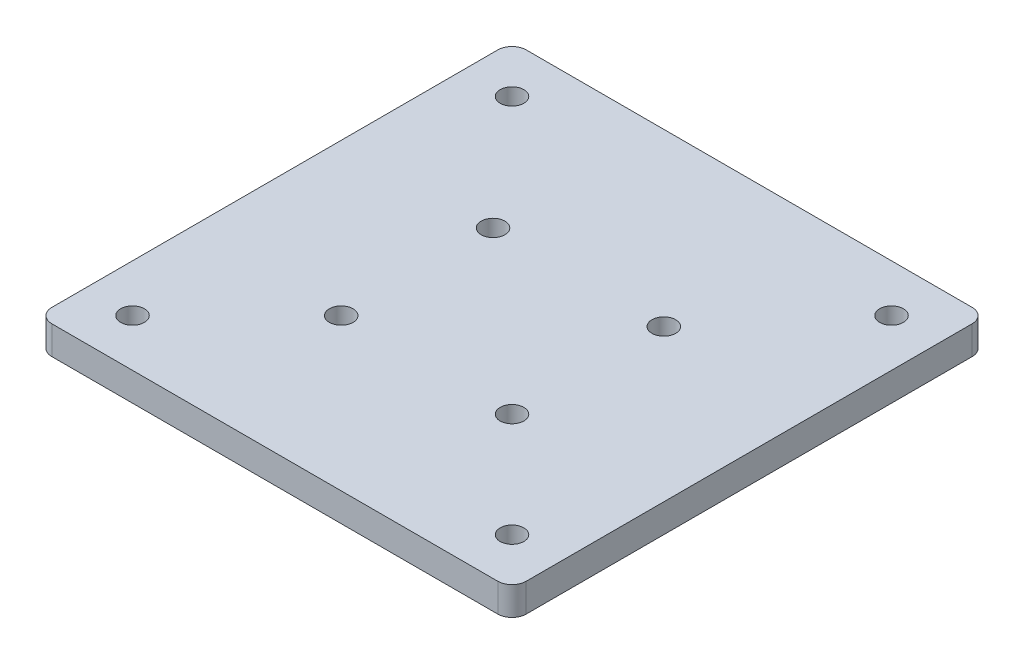
ISO-10303-21;
HEADER;
FILE_DESCRIPTION(('STEP AP214'),'2;1');
FILE_NAME('part.step','',(''),(''),'','','');
FILE_SCHEMA(('AUTOMOTIVE_DESIGN { 1 0 10303 214 1 1 1 1 }'));
ENDSEC;
DATA;
#1=APPLICATION_CONTEXT('core data for automotive mechanical design processes');
#2=APPLICATION_PROTOCOL_DEFINITION('international standard','automotive_design',2000,#1);
#3=PRODUCT_CONTEXT('',#1,'mechanical');
#4=PRODUCT('Part','Part','',(#3));
#5=PRODUCT_RELATED_PRODUCT_CATEGORY('part','',(#4));
#6=PRODUCT_DEFINITION_FORMATION('','',#4);
#7=PRODUCT_DEFINITION_CONTEXT('part definition',#1,'design');
#8=PRODUCT_DEFINITION('design','',#6,#7);
#9=PRODUCT_DEFINITION_SHAPE('','',#8);
#10=(LENGTH_UNIT() NAMED_UNIT(*) SI_UNIT(.MILLI.,.METRE.));
#11=(NAMED_UNIT(*) PLANE_ANGLE_UNIT() SI_UNIT($,.RADIAN.));
#12=(NAMED_UNIT(*) SI_UNIT($,.STERADIAN.) SOLID_ANGLE_UNIT());
#13=UNCERTAINTY_MEASURE_WITH_UNIT(LENGTH_MEASURE(1.E-05),#10,'distance_accuracy_value','');
#14=(GEOMETRIC_REPRESENTATION_CONTEXT(3) GLOBAL_UNCERTAINTY_ASSIGNED_CONTEXT((#13)) GLOBAL_UNIT_ASSIGNED_CONTEXT((#10,
#11,#12)) REPRESENTATION_CONTEXT('',''));
#15=CARTESIAN_POINT('',(0.,0.,0.));
#16=DIRECTION('',(0.,0.,1.));
#17=DIRECTION('',(1.,0.,0.));
#18=AXIS2_PLACEMENT_3D('',#15,#16,#17);
#19=CARTESIAN_POINT('',(-260.,25.5,260.103812648701));
#20=DIRECTION('',(0.,1.,0.));
#21=DIRECTION('',(0.,0.,1.));
#22=AXIS2_PLACEMENT_3D('',#19,#20,#21);
#23=PLANE('',#22);
#24=CARTESIAN_POINT('',(-95.0000000000001,25.5,-144.896187351299));
#25=DIRECTION('',(0.,1.,0.));
#26=DIRECTION('',(0.,0.,1.));
#27=AXIS2_PLACEMENT_3D('',#24,#25,#26);
#28=CIRCLE('',#27,18.75);
#29=CARTESIAN_POINT('',(-95.0000000000001,25.5,-126.146187351299));
#30=VERTEX_POINT('',#29);
#31=EDGE_CURVE('E257',#30,#30,#28,.T.);
#32=ORIENTED_EDGE('',*,*,#31,.F.);
#33=EDGE_LOOP('',(#32));
#34=FACE_BOUND('',#33,.T.);
#35=CARTESIAN_POINT('',(-95.,25.5,95.1038126487005));
#36=DIRECTION('',(0.,1.,0.));
#37=DIRECTION('',(0.,0.,1.));
#38=AXIS2_PLACEMENT_3D('',#35,#36,#37);
#39=CIRCLE('',#38,18.75);
#40=CARTESIAN_POINT('',(-95.,25.5,113.853812648701));
#41=VERTEX_POINT('',#40);
#42=EDGE_CURVE('E241',#41,#41,#39,.T.);
#43=ORIENTED_EDGE('',*,*,#42,.F.);
#44=EDGE_LOOP('',(#43));
#45=FACE_BOUND('',#44,.T.);
#46=CARTESIAN_POINT('',(-260.,25.5,-339.8961873513));
#47=DIRECTION('',(0.,1.,0.));
#48=DIRECTION('',(0.,0.,1.));
#49=AXIS2_PLACEMENT_3D('',#46,#47,#48);
#50=CIRCLE('',#49,18.75);
#51=CARTESIAN_POINT('',(-260.,25.5,-321.1461873513));
#52=VERTEX_POINT('',#51);
#53=EDGE_CURVE('E225',#52,#52,#50,.T.);
#54=ORIENTED_EDGE('',*,*,#53,.F.);
#55=EDGE_LOOP('',(#54));
#56=FACE_BOUND('',#55,.T.);
#57=CARTESIAN_POINT('',(-260.,25.5,260.103812648701));
#58=DIRECTION('',(0.,1.,0.));
#59=DIRECTION('',(0.,0.,1.));
#60=AXIS2_PLACEMENT_3D('',#57,#58,#59);
#61=CIRCLE('',#60,18.75);
#62=CARTESIAN_POINT('',(-260.,25.5,278.853812648701));
#63=VERTEX_POINT('',#62);
#64=EDGE_CURVE('E142',#63,#63,#61,.T.);
#65=ORIENTED_EDGE('',*,*,#64,.F.);
#66=EDGE_LOOP('',(#65));
#67=FACE_BOUND('',#66,.T.);
#68=DIRECTION('',(-1.,0.,0.));
#69=VECTOR('',#68,1.);
#70=CARTESIAN_POINT('',(-335.,25.5,-414.8961873513));
#71=LINE('',#70,#69);
#72=CARTESIAN_POINT('',(392.5,25.5,-414.8961873513));
#73=VERTEX_POINT('',#72);
#74=CARTESIAN_POINT('',(-312.5,25.5,-414.8961873513));
#75=VERTEX_POINT('',#74);
#76=EDGE_CURVE('E150',#73,#75,#71,.T.);
#77=ORIENTED_EDGE('',*,*,#76,.T.);
#78=CARTESIAN_POINT('',(-312.5,25.5,-392.3961873513));
#79=DIRECTION('',(0.,1.,0.));
#80=DIRECTION('',(0.,0.,1.));
#81=AXIS2_PLACEMENT_3D('',#78,#79,#80);
#82=CIRCLE('',#81,22.5);
#83=CARTESIAN_POINT('',(-335.,25.5,-392.3961873513));
#84=VERTEX_POINT('',#83);
#85=EDGE_CURVE('E47',#75,#84,#82,.T.);
#86=ORIENTED_EDGE('',*,*,#85,.T.);
#87=DIRECTION('',(0.,0.,1.));
#88=VECTOR('',#87,1.);
#89=CARTESIAN_POINT('',(-335.,25.5,-414.8961873513));
#90=LINE('',#89,#88);
#91=CARTESIAN_POINT('',(-335.,25.5,312.603812648701));
#92=VERTEX_POINT('',#91);
#93=EDGE_CURVE('E148',#84,#92,#90,.T.);
#94=ORIENTED_EDGE('',*,*,#93,.T.);
#95=CARTESIAN_POINT('',(-312.5,25.5,312.603812648701));
#96=DIRECTION('',(0.,1.,0.));
#97=DIRECTION('',(0.,0.,1.));
#98=AXIS2_PLACEMENT_3D('',#95,#96,#97);
#99=CIRCLE('',#98,22.5);
#100=CARTESIAN_POINT('',(-312.5,25.5,335.103812648701));
#101=VERTEX_POINT('',#100);
#102=EDGE_CURVE('E159',#92,#101,#99,.T.);
#103=ORIENTED_EDGE('',*,*,#102,.T.);
#104=DIRECTION('',(1.,0.,0.));
#105=VECTOR('',#104,1.);
#106=CARTESIAN_POINT('',(-335.,25.5,335.103812648701));
#107=LINE('',#106,#105);
#108=CARTESIAN_POINT('',(392.5,25.5,335.103812648701));
#109=VERTEX_POINT('',#108);
#110=EDGE_CURVE('E127',#101,#109,#107,.T.);
#111=ORIENTED_EDGE('',*,*,#110,.T.);
#112=CARTESIAN_POINT('',(392.5,25.5,312.603812648701));
#113=DIRECTION('',(0.,1.,0.));
#114=DIRECTION('',(0.,0.,1.));
#115=AXIS2_PLACEMENT_3D('',#112,#113,#114);
#116=CIRCLE('',#115,22.5);
#117=CARTESIAN_POINT('',(415.,25.5,312.603812648701));
#118=VERTEX_POINT('',#117);
#119=EDGE_CURVE('E156',#109,#118,#116,.T.);
#120=ORIENTED_EDGE('',*,*,#119,.T.);
#121=DIRECTION('',(0.,0.,-1.));
#122=VECTOR('',#121,1.);
#123=CARTESIAN_POINT('',(415.,25.5,-414.8961873513));
#124=LINE('',#123,#122);
#125=CARTESIAN_POINT('',(415.,25.5,-392.3961873513));
#126=VERTEX_POINT('',#125);
#127=EDGE_CURVE('E203',#118,#126,#124,.T.);
#128=ORIENTED_EDGE('',*,*,#127,.T.);
#129=CARTESIAN_POINT('',(392.5,25.5,-392.3961873513));
#130=DIRECTION('',(0.,1.,0.));
#131=DIRECTION('',(0.,0.,1.));
#132=AXIS2_PLACEMENT_3D('',#129,#130,#131);
#133=CIRCLE('',#132,22.5);
#134=EDGE_CURVE('E182',#126,#73,#133,.T.);
#135=ORIENTED_EDGE('',*,*,#134,.T.);
#136=EDGE_LOOP('',(#77,#86,#94,#103,#111,#120,#128,#135));
#137=FACE_BOUND('',#136,.T.);
#138=CARTESIAN_POINT('',(340.,25.5,260.103812648701));
#139=DIRECTION('',(0.,1.,0.));
#140=DIRECTION('',(0.,0.,1.));
#141=AXIS2_PLACEMENT_3D('',#138,#139,#140);
#142=CIRCLE('',#141,18.75);
#143=CARTESIAN_POINT('',(340.,25.5,278.853812648701));
#144=VERTEX_POINT('',#143);
#145=EDGE_CURVE('E217',#144,#144,#142,.T.);
#146=ORIENTED_EDGE('',*,*,#145,.F.);
#147=EDGE_LOOP('',(#146));
#148=FACE_BOUND('',#147,.T.);
#149=CARTESIAN_POINT('',(340.,25.5,-339.8961873513));
#150=DIRECTION('',(0.,1.,0.));
#151=DIRECTION('',(0.,0.,1.));
#152=AXIS2_PLACEMENT_3D('',#149,#150,#151);
#153=CIRCLE('',#152,18.75);
#154=CARTESIAN_POINT('',(340.,25.5,-321.1461873513));
#155=VERTEX_POINT('',#154);
#156=EDGE_CURVE('E233',#155,#155,#153,.T.);
#157=ORIENTED_EDGE('',*,*,#156,.F.);
#158=EDGE_LOOP('',(#157));
#159=FACE_BOUND('',#158,.T.);
#160=CARTESIAN_POINT('',(175.,25.5,95.1038126487005));
#161=DIRECTION('',(0.,1.,0.));
#162=DIRECTION('',(0.,0.,1.));
#163=AXIS2_PLACEMENT_3D('',#160,#161,#162);
#164=CIRCLE('',#163,18.75);
#165=CARTESIAN_POINT('',(175.,25.5,113.853812648701));
#166=VERTEX_POINT('',#165);
#167=EDGE_CURVE('E249',#166,#166,#164,.T.);
#168=ORIENTED_EDGE('',*,*,#167,.F.);
#169=EDGE_LOOP('',(#168));
#170=FACE_BOUND('',#169,.T.);
#171=CARTESIAN_POINT('',(175.,25.5,-144.8961873513));
#172=DIRECTION('',(0.,1.,0.));
#173=DIRECTION('',(0.,0.,1.));
#174=AXIS2_PLACEMENT_3D('',#171,#172,#173);
#175=CIRCLE('',#174,18.7500000000001);
#176=CARTESIAN_POINT('',(175.,25.5,-126.146187351299));
#177=VERTEX_POINT('',#176);
#178=EDGE_CURVE('E265',#177,#177,#175,.T.);
#179=ORIENTED_EDGE('',*,*,#178,.F.);
#180=EDGE_LOOP('',(#179));
#181=FACE_BOUND('',#180,.T.);
#182=ADVANCED_FACE('F38',(#34,#45,#56,#67,#137,#148,#159,#170,#181),#23,.T.);
#183=CARTESIAN_POINT('',(-260.,-19.5,260.103812648701));
#184=DIRECTION('',(0.,1.,0.));
#185=DIRECTION('',(0.,0.,1.));
#186=AXIS2_PLACEMENT_3D('',#183,#184,#185);
#187=PLANE('',#186);
#188=CARTESIAN_POINT('',(-95.0000000000001,-19.5,-144.896187351299));
#189=DIRECTION('',(0.,1.,0.));
#190=DIRECTION('',(0.,0.,1.));
#191=AXIS2_PLACEMENT_3D('',#188,#189,#190);
#192=CIRCLE('',#191,18.75);
#193=CARTESIAN_POINT('',(-95.0000000000001,-19.5,-126.146187351299));
#194=VERTEX_POINT('',#193);
#195=EDGE_CURVE('E261',#194,#194,#192,.T.);
#196=ORIENTED_EDGE('',*,*,#195,.T.);
#197=EDGE_LOOP('',(#196));
#198=FACE_BOUND('',#197,.T.);
#199=CARTESIAN_POINT('',(-95.,-19.5,95.1038126487005));
#200=DIRECTION('',(0.,1.,0.));
#201=DIRECTION('',(0.,0.,1.));
#202=AXIS2_PLACEMENT_3D('',#199,#200,#201);
#203=CIRCLE('',#202,18.75);
#204=CARTESIAN_POINT('',(-95.,-19.5,113.853812648701));
#205=VERTEX_POINT('',#204);
#206=EDGE_CURVE('E245',#205,#205,#203,.T.);
#207=ORIENTED_EDGE('',*,*,#206,.T.);
#208=EDGE_LOOP('',(#207));
#209=FACE_BOUND('',#208,.T.);
#210=CARTESIAN_POINT('',(-260.,-19.5,-339.8961873513));
#211=DIRECTION('',(0.,1.,0.));
#212=DIRECTION('',(0.,0.,1.));
#213=AXIS2_PLACEMENT_3D('',#210,#211,#212);
#214=CIRCLE('',#213,18.75);
#215=CARTESIAN_POINT('',(-260.,-19.5,-321.1461873513));
#216=VERTEX_POINT('',#215);
#217=EDGE_CURVE('E229',#216,#216,#214,.T.);
#218=ORIENTED_EDGE('',*,*,#217,.T.);
#219=EDGE_LOOP('',(#218));
#220=FACE_BOUND('',#219,.T.);
#221=CARTESIAN_POINT('',(-260.,-19.5,260.103812648701));
#222=DIRECTION('',(0.,1.,0.));
#223=DIRECTION('',(0.,0.,1.));
#224=AXIS2_PLACEMENT_3D('',#221,#222,#223);
#225=CIRCLE('',#224,18.75);
#226=CARTESIAN_POINT('',(-260.,-19.5,278.853812648701));
#227=VERTEX_POINT('',#226);
#228=EDGE_CURVE('E213',#227,#227,#225,.T.);
#229=ORIENTED_EDGE('',*,*,#228,.T.);
#230=EDGE_LOOP('',(#229));
#231=FACE_BOUND('',#230,.T.);
#232=DIRECTION('',(0.,0.,1.));
#233=VECTOR('',#232,1.);
#234=CARTESIAN_POINT('',(-335.,-19.5,-414.8961873513));
#235=LINE('',#234,#233);
#236=CARTESIAN_POINT('',(-335.,-19.5,-392.3961873513));
#237=VERTEX_POINT('',#236);
#238=CARTESIAN_POINT('',(-335.,-19.5,312.603812648701));
#239=VERTEX_POINT('',#238);
#240=EDGE_CURVE('E136',#237,#239,#235,.T.);
#241=ORIENTED_EDGE('',*,*,#240,.F.);
#242=CARTESIAN_POINT('',(-312.5,-19.5,-392.3961873513));
#243=DIRECTION('',(0.,1.,0.));
#244=DIRECTION('',(0.,0.,1.));
#245=AXIS2_PLACEMENT_3D('',#242,#243,#244);
#246=CIRCLE('',#245,22.5);
#247=CARTESIAN_POINT('',(-312.5,-19.5,-414.8961873513));
#248=VERTEX_POINT('',#247);
#249=EDGE_CURVE('E173',#237,#248,#246,.F.);
#250=ORIENTED_EDGE('',*,*,#249,.T.);
#251=DIRECTION('',(-1.,0.,0.));
#252=VECTOR('',#251,1.);
#253=CARTESIAN_POINT('',(-335.,-19.5,-414.8961873513));
#254=LINE('',#253,#252);
#255=CARTESIAN_POINT('',(392.5,-19.5,-414.8961873513));
#256=VERTEX_POINT('',#255);
#257=EDGE_CURVE('E140',#256,#248,#254,.T.);
#258=ORIENTED_EDGE('',*,*,#257,.F.);
#259=CARTESIAN_POINT('',(392.5,-19.5,-392.3961873513));
#260=DIRECTION('',(0.,1.,0.));
#261=DIRECTION('',(0.,0.,1.));
#262=AXIS2_PLACEMENT_3D('',#259,#260,#261);
#263=CIRCLE('',#262,22.5);
#264=CARTESIAN_POINT('',(415.,-19.5,-392.3961873513));
#265=VERTEX_POINT('',#264);
#266=EDGE_CURVE('E170',#256,#265,#263,.F.);
#267=ORIENTED_EDGE('',*,*,#266,.T.);
#268=DIRECTION('',(0.,0.,-1.));
#269=VECTOR('',#268,1.);
#270=CARTESIAN_POINT('',(415.,-19.5,-414.8961873513));
#271=LINE('',#270,#269);
#272=CARTESIAN_POINT('',(415.,-19.5,312.603812648701));
#273=VERTEX_POINT('',#272);
#274=EDGE_CURVE('E135',#273,#265,#271,.T.);
#275=ORIENTED_EDGE('',*,*,#274,.F.);
#276=CARTESIAN_POINT('',(392.5,-19.5,312.603812648701));
#277=DIRECTION('',(0.,1.,0.));
#278=DIRECTION('',(0.,0.,1.));
#279=AXIS2_PLACEMENT_3D('',#276,#277,#278);
#280=CIRCLE('',#279,22.5);
#281=CARTESIAN_POINT('',(392.5,-19.5,335.103812648701));
#282=VERTEX_POINT('',#281);
#283=EDGE_CURVE('E118',#273,#282,#280,.F.);
#284=ORIENTED_EDGE('',*,*,#283,.T.);
#285=DIRECTION('',(1.,0.,0.));
#286=VECTOR('',#285,1.);
#287=CARTESIAN_POINT('',(-335.,-19.5,335.103812648701));
#288=LINE('',#287,#286);
#289=CARTESIAN_POINT('',(-312.5,-19.5,335.103812648701));
#290=VERTEX_POINT('',#289);
#291=EDGE_CURVE('E124',#290,#282,#288,.T.);
#292=ORIENTED_EDGE('',*,*,#291,.F.);
#293=CARTESIAN_POINT('',(-312.5,-19.5,312.603812648701));
#294=DIRECTION('',(0.,1.,0.));
#295=DIRECTION('',(0.,0.,1.));
#296=AXIS2_PLACEMENT_3D('',#293,#294,#295);
#297=CIRCLE('',#296,22.5);
#298=EDGE_CURVE('E107',#290,#239,#297,.F.);
#299=ORIENTED_EDGE('',*,*,#298,.T.);
#300=EDGE_LOOP('',(#241,#250,#258,#267,#275,#284,#292,#299));
#301=FACE_BOUND('',#300,.T.);
#302=CARTESIAN_POINT('',(340.,-19.5,260.103812648701));
#303=DIRECTION('',(0.,1.,0.));
#304=DIRECTION('',(0.,0.,1.));
#305=AXIS2_PLACEMENT_3D('',#302,#303,#304);
#306=CIRCLE('',#305,18.75);
#307=CARTESIAN_POINT('',(340.,-19.5,278.853812648701));
#308=VERTEX_POINT('',#307);
#309=EDGE_CURVE('E221',#308,#308,#306,.T.);
#310=ORIENTED_EDGE('',*,*,#309,.T.);
#311=EDGE_LOOP('',(#310));
#312=FACE_BOUND('',#311,.T.);
#313=CARTESIAN_POINT('',(340.,-19.5,-339.8961873513));
#314=DIRECTION('',(0.,1.,0.));
#315=DIRECTION('',(0.,0.,1.));
#316=AXIS2_PLACEMENT_3D('',#313,#314,#315);
#317=CIRCLE('',#316,18.75);
#318=CARTESIAN_POINT('',(340.,-19.5,-321.1461873513));
#319=VERTEX_POINT('',#318);
#320=EDGE_CURVE('E237',#319,#319,#317,.T.);
#321=ORIENTED_EDGE('',*,*,#320,.T.);
#322=EDGE_LOOP('',(#321));
#323=FACE_BOUND('',#322,.T.);
#324=CARTESIAN_POINT('',(175.,-19.5,95.1038126487005));
#325=DIRECTION('',(0.,1.,0.));
#326=DIRECTION('',(0.,0.,1.));
#327=AXIS2_PLACEMENT_3D('',#324,#325,#326);
#328=CIRCLE('',#327,18.75);
#329=CARTESIAN_POINT('',(175.,-19.5,113.853812648701));
#330=VERTEX_POINT('',#329);
#331=EDGE_CURVE('E253',#330,#330,#328,.T.);
#332=ORIENTED_EDGE('',*,*,#331,.T.);
#333=EDGE_LOOP('',(#332));
#334=FACE_BOUND('',#333,.T.);
#335=CARTESIAN_POINT('',(175.,-19.5,-144.8961873513));
#336=DIRECTION('',(0.,1.,0.));
#337=DIRECTION('',(0.,0.,1.));
#338=AXIS2_PLACEMENT_3D('',#335,#336,#337);
#339=CIRCLE('',#338,18.7500000000001);
#340=CARTESIAN_POINT('',(175.,-19.5,-126.146187351299));
#341=VERTEX_POINT('',#340);
#342=EDGE_CURVE('E269',#341,#341,#339,.T.);
#343=ORIENTED_EDGE('',*,*,#342,.T.);
#344=EDGE_LOOP('',(#343));
#345=FACE_BOUND('',#344,.T.);
#346=ADVANCED_FACE('F131',(#198,#209,#220,#231,#301,#312,#323,#334,#345),#187,.F.);
#347=CARTESIAN_POINT('',(-335.,25.5,-414.8961873513));
#348=DIRECTION('',(1.,0.,0.));
#349=DIRECTION('',(0.,0.,-1.));
#350=AXIS2_PLACEMENT_3D('',#347,#348,#349);
#351=PLANE('',#350);
#352=ORIENTED_EDGE('',*,*,#93,.F.);
#353=DIRECTION('',(0.,-1.,0.));
#354=VECTOR('',#353,1.);
#355=CARTESIAN_POINT('',(-335.,25.5,-392.3961873513));
#356=LINE('',#355,#354);
#357=EDGE_CURVE('E166',#84,#237,#356,.T.);
#358=ORIENTED_EDGE('',*,*,#357,.T.);
#359=ORIENTED_EDGE('',*,*,#240,.T.);
#360=DIRECTION('',(0.,-1.,0.));
#361=VECTOR('',#360,1.);
#362=CARTESIAN_POINT('',(-335.,25.5,312.603812648701));
#363=LINE('',#362,#361);
#364=EDGE_CURVE('E113',#239,#92,#363,.F.);
#365=ORIENTED_EDGE('',*,*,#364,.T.);
#366=EDGE_LOOP('',(#352,#358,#359,#365));
#367=FACE_BOUND('',#366,.T.);
#368=ADVANCED_FACE('F192',(#367),#351,.F.);
#369=CARTESIAN_POINT('',(-335.,25.5,335.103812648701));
#370=DIRECTION('',(0.,0.,-1.));
#371=DIRECTION('',(-1.,0.,0.));
#372=AXIS2_PLACEMENT_3D('',#369,#370,#371);
#373=PLANE('',#372);
#374=ORIENTED_EDGE('',*,*,#110,.F.);
#375=DIRECTION('',(0.,-1.,0.));
#376=VECTOR('',#375,1.);
#377=CARTESIAN_POINT('',(-312.5,25.5,335.103812648701));
#378=LINE('',#377,#376);
#379=EDGE_CURVE('E111',#101,#290,#378,.T.);
#380=ORIENTED_EDGE('',*,*,#379,.T.);
#381=ORIENTED_EDGE('',*,*,#291,.T.);
#382=DIRECTION('',(0.,-1.,0.));
#383=VECTOR('',#382,1.);
#384=CARTESIAN_POINT('',(392.5,25.5,335.103812648701));
#385=LINE('',#384,#383);
#386=EDGE_CURVE('E129',#282,#109,#385,.F.);
#387=ORIENTED_EDGE('',*,*,#386,.T.);
#388=EDGE_LOOP('',(#374,#380,#381,#387));
#389=FACE_BOUND('',#388,.T.);
#390=ADVANCED_FACE('F123',(#389),#373,.F.);
#391=CARTESIAN_POINT('',(415.,25.5,-414.8961873513));
#392=DIRECTION('',(-1.,0.,0.));
#393=DIRECTION('',(0.,0.,1.));
#394=AXIS2_PLACEMENT_3D('',#391,#392,#393);
#395=PLANE('',#394);
#396=ORIENTED_EDGE('',*,*,#274,.T.);
#397=DIRECTION('',(0.,-1.,0.));
#398=VECTOR('',#397,1.);
#399=CARTESIAN_POINT('',(415.,25.5,-392.3961873513));
#400=LINE('',#399,#398);
#401=EDGE_CURVE('E11',#265,#126,#400,.F.);
#402=ORIENTED_EDGE('',*,*,#401,.T.);
#403=ORIENTED_EDGE('',*,*,#127,.F.);
#404=DIRECTION('',(0.,-1.,0.));
#405=VECTOR('',#404,1.);
#406=CARTESIAN_POINT('',(415.,25.5,312.603812648701));
#407=LINE('',#406,#405);
#408=EDGE_CURVE('E162',#118,#273,#407,.T.);
#409=ORIENTED_EDGE('',*,*,#408,.T.);
#410=EDGE_LOOP('',(#396,#402,#403,#409));
#411=FACE_BOUND('',#410,.T.);
#412=ADVANCED_FACE('F201',(#411),#395,.F.);
#413=CARTESIAN_POINT('',(-335.,25.5,-414.8961873513));
#414=DIRECTION('',(0.,0.,1.));
#415=DIRECTION('',(1.,0.,0.));
#416=AXIS2_PLACEMENT_3D('',#413,#414,#415);
#417=PLANE('',#416);
#418=ORIENTED_EDGE('',*,*,#257,.T.);
#419=DIRECTION('',(0.,-1.,0.));
#420=VECTOR('',#419,1.);
#421=CARTESIAN_POINT('',(-312.5,25.5,-414.8961873513));
#422=LINE('',#421,#420);
#423=EDGE_CURVE('E60',#248,#75,#422,.F.);
#424=ORIENTED_EDGE('',*,*,#423,.T.);
#425=ORIENTED_EDGE('',*,*,#76,.F.);
#426=DIRECTION('',(0.,-1.,0.));
#427=VECTOR('',#426,1.);
#428=CARTESIAN_POINT('',(392.5,25.5,-414.8961873513));
#429=LINE('',#428,#427);
#430=EDGE_CURVE('E176',#73,#256,#429,.T.);
#431=ORIENTED_EDGE('',*,*,#430,.T.);
#432=EDGE_LOOP('',(#418,#424,#425,#431));
#433=FACE_BOUND('',#432,.T.);
#434=ADVANCED_FACE('F197',(#433),#417,.F.);
#435=CARTESIAN_POINT('',(-260.,25.5,260.103812648701));
#436=DIRECTION('',(0.,-1.,0.));
#437=DIRECTION('',(0.,0.,-1.));
#438=AXIS2_PLACEMENT_3D('',#435,#436,#437);
#439=CYLINDRICAL_SURFACE('',#438,18.75);
#440=ORIENTED_EDGE('',*,*,#64,.T.);
#441=EDGE_LOOP('',(#440));
#442=FACE_BOUND('',#441,.T.);
#443=ORIENTED_EDGE('',*,*,#228,.F.);
#444=EDGE_LOOP('',(#443));
#445=FACE_BOUND('',#444,.T.);
#446=ADVANCED_FACE('F291',(#442,#445),#439,.F.);
#447=CARTESIAN_POINT('',(340.,25.5,260.103812648701));
#448=DIRECTION('',(0.,-1.,0.));
#449=DIRECTION('',(0.,0.,-1.));
#450=AXIS2_PLACEMENT_3D('',#447,#448,#449);
#451=CYLINDRICAL_SURFACE('',#450,18.75);
#452=ORIENTED_EDGE('',*,*,#145,.T.);
#453=EDGE_LOOP('',(#452));
#454=FACE_BOUND('',#453,.T.);
#455=ORIENTED_EDGE('',*,*,#309,.F.);
#456=EDGE_LOOP('',(#455));
#457=FACE_BOUND('',#456,.T.);
#458=ADVANCED_FACE('F385',(#454,#457),#451,.F.);
#459=CARTESIAN_POINT('',(-260.,25.5,-339.8961873513));
#460=DIRECTION('',(0.,-1.,0.));
#461=DIRECTION('',(0.,0.,-1.));
#462=AXIS2_PLACEMENT_3D('',#459,#460,#461);
#463=CYLINDRICAL_SURFACE('',#462,18.75);
#464=ORIENTED_EDGE('',*,*,#53,.T.);
#465=EDGE_LOOP('',(#464));
#466=FACE_BOUND('',#465,.T.);
#467=ORIENTED_EDGE('',*,*,#217,.F.);
#468=EDGE_LOOP('',(#467));
#469=FACE_BOUND('',#468,.T.);
#470=ADVANCED_FACE('F375',(#466,#469),#463,.F.);
#471=CARTESIAN_POINT('',(340.,25.5,-339.8961873513));
#472=DIRECTION('',(0.,-1.,0.));
#473=DIRECTION('',(0.,0.,-1.));
#474=AXIS2_PLACEMENT_3D('',#471,#472,#473);
#475=CYLINDRICAL_SURFACE('',#474,18.75);
#476=ORIENTED_EDGE('',*,*,#156,.T.);
#477=EDGE_LOOP('',(#476));
#478=FACE_BOUND('',#477,.T.);
#479=ORIENTED_EDGE('',*,*,#320,.F.);
#480=EDGE_LOOP('',(#479));
#481=FACE_BOUND('',#480,.T.);
#482=ADVANCED_FACE('F365',(#478,#481),#475,.F.);
#483=CARTESIAN_POINT('',(-95.,25.5,95.1038126487005));
#484=DIRECTION('',(0.,-1.,0.));
#485=DIRECTION('',(0.,0.,-1.));
#486=AXIS2_PLACEMENT_3D('',#483,#484,#485);
#487=CYLINDRICAL_SURFACE('',#486,18.75);
#488=ORIENTED_EDGE('',*,*,#42,.T.);
#489=EDGE_LOOP('',(#488));
#490=FACE_BOUND('',#489,.T.);
#491=ORIENTED_EDGE('',*,*,#206,.F.);
#492=EDGE_LOOP('',(#491));
#493=FACE_BOUND('',#492,.T.);
#494=ADVANCED_FACE('F355',(#490,#493),#487,.F.);
#495=CARTESIAN_POINT('',(175.,25.5,95.1038126487005));
#496=DIRECTION('',(0.,-1.,0.));
#497=DIRECTION('',(0.,0.,-1.));
#498=AXIS2_PLACEMENT_3D('',#495,#496,#497);
#499=CYLINDRICAL_SURFACE('',#498,18.75);
#500=ORIENTED_EDGE('',*,*,#167,.T.);
#501=EDGE_LOOP('',(#500));
#502=FACE_BOUND('',#501,.T.);
#503=ORIENTED_EDGE('',*,*,#331,.F.);
#504=EDGE_LOOP('',(#503));
#505=FACE_BOUND('',#504,.T.);
#506=ADVANCED_FACE('F345',(#502,#505),#499,.F.);
#507=CARTESIAN_POINT('',(-95.0000000000001,25.5,-144.896187351299));
#508=DIRECTION('',(0.,-1.,0.));
#509=DIRECTION('',(0.,0.,-1.));
#510=AXIS2_PLACEMENT_3D('',#507,#508,#509);
#511=CYLINDRICAL_SURFACE('',#510,18.75);
#512=ORIENTED_EDGE('',*,*,#31,.T.);
#513=EDGE_LOOP('',(#512));
#514=FACE_BOUND('',#513,.T.);
#515=ORIENTED_EDGE('',*,*,#195,.F.);
#516=EDGE_LOOP('',(#515));
#517=FACE_BOUND('',#516,.T.);
#518=ADVANCED_FACE('F336',(#514,#517),#511,.F.);
#519=CARTESIAN_POINT('',(175.,25.5,-144.8961873513));
#520=DIRECTION('',(0.,-1.,0.));
#521=DIRECTION('',(0.,0.,-1.));
#522=AXIS2_PLACEMENT_3D('',#519,#520,#521);
#523=CYLINDRICAL_SURFACE('',#522,18.7500000000001);
#524=ORIENTED_EDGE('',*,*,#178,.T.);
#525=EDGE_LOOP('',(#524));
#526=FACE_BOUND('',#525,.T.);
#527=ORIENTED_EDGE('',*,*,#342,.F.);
#528=EDGE_LOOP('',(#527));
#529=FACE_BOUND('',#528,.T.);
#530=ADVANCED_FACE('F277',(#526,#529),#523,.F.);
#531=CARTESIAN_POINT('',(-312.5,25.5,312.603812648701));
#532=DIRECTION('',(0.,-1.,0.));
#533=DIRECTION('',(0.,0.,-1.));
#534=AXIS2_PLACEMENT_3D('',#531,#532,#533);
#535=CYLINDRICAL_SURFACE('',#534,22.5);
#536=ORIENTED_EDGE('',*,*,#102,.F.);
#537=ORIENTED_EDGE('',*,*,#364,.F.);
#538=ORIENTED_EDGE('',*,*,#298,.F.);
#539=ORIENTED_EDGE('',*,*,#379,.F.);
#540=EDGE_LOOP('',(#536,#537,#538,#539));
#541=FACE_BOUND('',#540,.T.);
#542=ADVANCED_FACE('F110',(#541),#535,.T.);
#543=CARTESIAN_POINT('',(392.5,25.5,312.603812648701));
#544=DIRECTION('',(0.,-1.,0.));
#545=DIRECTION('',(0.,0.,-1.));
#546=AXIS2_PLACEMENT_3D('',#543,#544,#545);
#547=CYLINDRICAL_SURFACE('',#546,22.5);
#548=ORIENTED_EDGE('',*,*,#119,.F.);
#549=ORIENTED_EDGE('',*,*,#386,.F.);
#550=ORIENTED_EDGE('',*,*,#283,.F.);
#551=ORIENTED_EDGE('',*,*,#408,.F.);
#552=EDGE_LOOP('',(#548,#549,#550,#551));
#553=FACE_BOUND('',#552,.T.);
#554=ADVANCED_FACE('F206',(#553),#547,.T.);
#555=CARTESIAN_POINT('',(-312.5,25.5,-392.3961873513));
#556=DIRECTION('',(0.,-1.,0.));
#557=DIRECTION('',(0.,0.,-1.));
#558=AXIS2_PLACEMENT_3D('',#555,#556,#557);
#559=CYLINDRICAL_SURFACE('',#558,22.5);
#560=ORIENTED_EDGE('',*,*,#85,.F.);
#561=ORIENTED_EDGE('',*,*,#423,.F.);
#562=ORIENTED_EDGE('',*,*,#249,.F.);
#563=ORIENTED_EDGE('',*,*,#357,.F.);
#564=EDGE_LOOP('',(#560,#561,#562,#563));
#565=FACE_BOUND('',#564,.T.);
#566=ADVANCED_FACE('F195',(#565),#559,.T.);
#567=CARTESIAN_POINT('',(392.5,25.5,-392.3961873513));
#568=DIRECTION('',(0.,-1.,0.));
#569=DIRECTION('',(0.,0.,-1.));
#570=AXIS2_PLACEMENT_3D('',#567,#568,#569);
#571=CYLINDRICAL_SURFACE('',#570,22.5);
#572=ORIENTED_EDGE('',*,*,#134,.F.);
#573=ORIENTED_EDGE('',*,*,#401,.F.);
#574=ORIENTED_EDGE('',*,*,#266,.F.);
#575=ORIENTED_EDGE('',*,*,#430,.F.);
#576=EDGE_LOOP('',(#572,#573,#574,#575));
#577=FACE_BOUND('',#576,.T.);
#578=ADVANCED_FACE('F40',(#577),#571,.T.);
#579=CLOSED_SHELL('',(#182,#346,#368,#390,#412,#434,#446,#458,#470,#482,#494,#506,#518,#530,
#542,#554,#566,#578));
#580=MANIFOLD_SOLID_BREP('B2',#579);
#581=ADVANCED_BREP_SHAPE_REPRESENTATION('',(#18,#580),#14);
#582=SHAPE_DEFINITION_REPRESENTATION(#9,#581);
ENDSEC;
END-ISO-10303-21;
